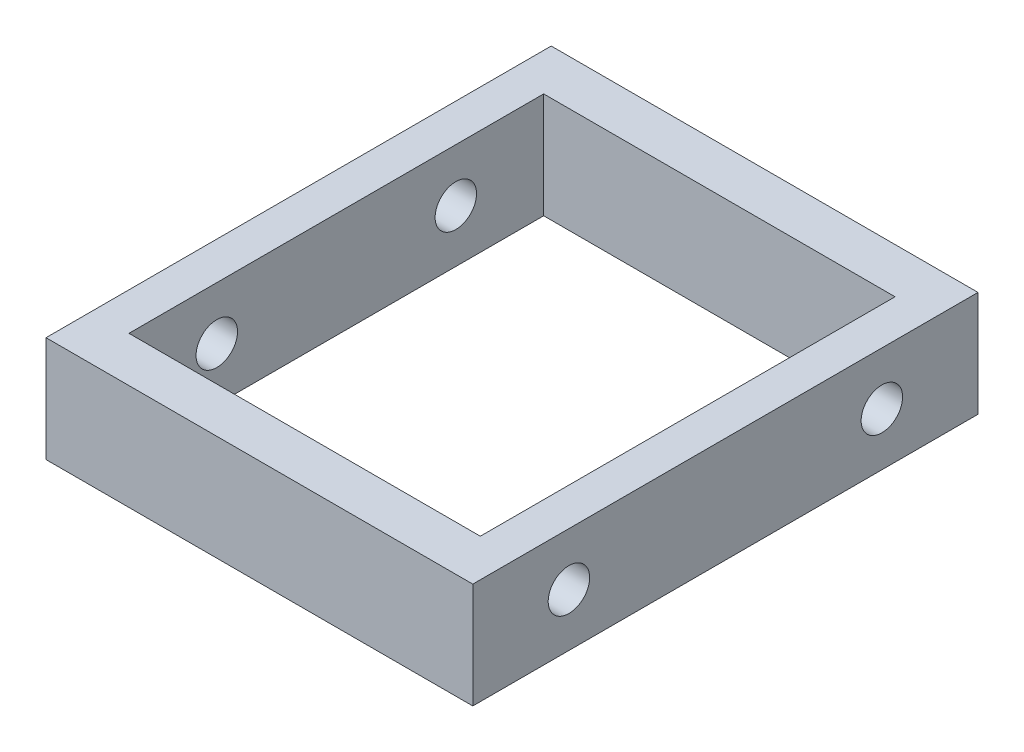
ISO-10303-21;
HEADER;
FILE_DESCRIPTION(('STEP AP214'),'2;1');
FILE_NAME('part.step','',(''),(''),'','','');
FILE_SCHEMA(('AUTOMOTIVE_DESIGN { 1 0 10303 214 1 1 1 1 }'));
ENDSEC;
DATA;
#1=APPLICATION_CONTEXT('core data for automotive mechanical design processes');
#2=APPLICATION_PROTOCOL_DEFINITION('international standard','automotive_design',2000,#1);
#3=PRODUCT_CONTEXT('',#1,'mechanical');
#4=PRODUCT('Part','Part','',(#3));
#5=PRODUCT_RELATED_PRODUCT_CATEGORY('part','',(#4));
#6=PRODUCT_DEFINITION_FORMATION('','',#4);
#7=PRODUCT_DEFINITION_CONTEXT('part definition',#1,'design');
#8=PRODUCT_DEFINITION('design','',#6,#7);
#9=PRODUCT_DEFINITION_SHAPE('','',#8);
#10=(LENGTH_UNIT() NAMED_UNIT(*) SI_UNIT(.MILLI.,.METRE.));
#11=(NAMED_UNIT(*) PLANE_ANGLE_UNIT() SI_UNIT($,.RADIAN.));
#12=(NAMED_UNIT(*) SI_UNIT($,.STERADIAN.) SOLID_ANGLE_UNIT());
#13=UNCERTAINTY_MEASURE_WITH_UNIT(LENGTH_MEASURE(1.E-05),#10,'distance_accuracy_value','');
#14=(GEOMETRIC_REPRESENTATION_CONTEXT(3) GLOBAL_UNCERTAINTY_ASSIGNED_CONTEXT((#13)) GLOBAL_UNIT_ASSIGNED_CONTEXT((#10,
#11,#12)) REPRESENTATION_CONTEXT('',''));
#15=CARTESIAN_POINT('',(0.,0.,0.));
#16=DIRECTION('',(0.,0.,1.));
#17=DIRECTION('',(1.,0.,0.));
#18=AXIS2_PLACEMENT_3D('',#15,#16,#17);
#19=CARTESIAN_POINT('',(0.,14.,33.5));
#20=DIRECTION('',(0.,0.,-1.));
#21=DIRECTION('',(-1.,0.,0.));
#22=AXIS2_PLACEMENT_3D('',#19,#20,#21);
#23=PLANE('',#22);
#24=DIRECTION('',(0.,1.,0.));
#25=VECTOR('',#24,1.);
#26=CARTESIAN_POINT('',(-28.3,14.,33.5));
#27=LINE('',#26,#25);
#28=CARTESIAN_POINT('',(-28.3,0.,33.5));
#29=VERTEX_POINT('',#28);
#30=CARTESIAN_POINT('',(-28.3,14.,33.5));
#31=VERTEX_POINT('',#30);
#32=EDGE_CURVE('E385',#29,#31,#27,.T.);
#33=ORIENTED_EDGE('',*,*,#32,.F.);
#34=DIRECTION('',(1.,0.,0.));
#35=VECTOR('',#34,1.);
#36=CARTESIAN_POINT('',(0.,0.,33.5));
#37=LINE('',#36,#35);
#38=CARTESIAN_POINT('',(28.3,0.,33.5));
#39=VERTEX_POINT('',#38);
#40=EDGE_CURVE('E312',#29,#39,#37,.T.);
#41=ORIENTED_EDGE('',*,*,#40,.T.);
#42=DIRECTION('',(0.,-1.,0.));
#43=VECTOR('',#42,1.);
#44=CARTESIAN_POINT('',(28.3,14.,33.5));
#45=LINE('',#44,#43);
#46=CARTESIAN_POINT('',(28.3,14.,33.5));
#47=VERTEX_POINT('',#46);
#48=EDGE_CURVE('E13',#47,#39,#45,.T.);
#49=ORIENTED_EDGE('',*,*,#48,.F.);
#50=DIRECTION('',(1.,0.,0.));
#51=VECTOR('',#50,1.);
#52=CARTESIAN_POINT('',(0.,14.,33.5));
#53=LINE('',#52,#51);
#54=EDGE_CURVE('E276',#31,#47,#53,.T.);
#55=ORIENTED_EDGE('',*,*,#54,.F.);
#56=EDGE_LOOP('',(#33,#41,#49,#55));
#57=FACE_BOUND('',#56,.T.);
#58=ADVANCED_FACE('F192',(#57),#23,.F.);
#59=CARTESIAN_POINT('',(0.,14.,-33.5));
#60=DIRECTION('',(0.,0.,-1.));
#61=DIRECTION('',(-1.,0.,0.));
#62=AXIS2_PLACEMENT_3D('',#59,#60,#61);
#63=PLANE('',#62);
#64=DIRECTION('',(1.,0.,0.));
#65=VECTOR('',#64,1.);
#66=CARTESIAN_POINT('',(0.,0.,-33.5));
#67=LINE('',#66,#65);
#68=CARTESIAN_POINT('',(-28.3,0.,-33.5));
#69=VERTEX_POINT('',#68);
#70=CARTESIAN_POINT('',(28.3,0.,-33.5));
#71=VERTEX_POINT('',#70);
#72=EDGE_CURVE('E245',#69,#71,#67,.T.);
#73=ORIENTED_EDGE('',*,*,#72,.F.);
#74=DIRECTION('',(0.,-1.,0.));
#75=VECTOR('',#74,1.);
#76=CARTESIAN_POINT('',(-28.3,14.,-33.5000000000001));
#77=LINE('',#76,#75);
#78=CARTESIAN_POINT('',(-28.3,14.,-33.5000000000001));
#79=VERTEX_POINT('',#78);
#80=EDGE_CURVE('E209',#79,#69,#77,.T.);
#81=ORIENTED_EDGE('',*,*,#80,.F.);
#82=DIRECTION('',(1.,0.,0.));
#83=VECTOR('',#82,1.);
#84=CARTESIAN_POINT('',(0.,14.,-33.5));
#85=LINE('',#84,#83);
#86=CARTESIAN_POINT('',(28.3,14.,-33.5));
#87=VERTEX_POINT('',#86);
#88=EDGE_CURVE('E299',#79,#87,#85,.T.);
#89=ORIENTED_EDGE('',*,*,#88,.T.);
#90=DIRECTION('',(0.,-1.,0.));
#91=VECTOR('',#90,1.);
#92=CARTESIAN_POINT('',(28.3,14.,-33.5));
#93=LINE('',#92,#91);
#94=EDGE_CURVE('E201',#87,#71,#93,.T.);
#95=ORIENTED_EDGE('',*,*,#94,.T.);
#96=EDGE_LOOP('',(#73,#81,#89,#95));
#97=FACE_BOUND('',#96,.T.);
#98=ADVANCED_FACE('F339',(#97),#63,.T.);
#99=CARTESIAN_POINT('',(0.,14.,0.));
#100=DIRECTION('',(0.,1.,0.));
#101=DIRECTION('',(0.,0.,1.));
#102=AXIS2_PLACEMENT_3D('',#99,#100,#101);
#103=PLANE('',#102);
#104=DIRECTION('',(0.,0.,-1.));
#105=VECTOR('',#104,1.);
#106=CARTESIAN_POINT('',(23.3,14.,0.));
#107=LINE('',#106,#105);
#108=CARTESIAN_POINT('',(23.3,14.,27.5));
#109=VERTEX_POINT('',#108);
#110=CARTESIAN_POINT('',(23.3,14.,-27.5));
#111=VERTEX_POINT('',#110);
#112=EDGE_CURVE('E269',#109,#111,#107,.T.);
#113=ORIENTED_EDGE('',*,*,#112,.F.);
#114=DIRECTION('',(1.,0.,0.));
#115=VECTOR('',#114,1.);
#116=CARTESIAN_POINT('',(0.,14.,27.5));
#117=LINE('',#116,#115);
#118=CARTESIAN_POINT('',(-23.3,14.,27.5));
#119=VERTEX_POINT('',#118);
#120=EDGE_CURVE('E287',#119,#109,#117,.T.);
#121=ORIENTED_EDGE('',*,*,#120,.F.);
#122=DIRECTION('',(0.,0.,-1.));
#123=VECTOR('',#122,1.);
#124=CARTESIAN_POINT('',(-23.3,14.,0.));
#125=LINE('',#124,#123);
#126=CARTESIAN_POINT('',(-23.3,14.,-27.5));
#127=VERTEX_POINT('',#126);
#128=EDGE_CURVE('E272',#119,#127,#125,.T.);
#129=ORIENTED_EDGE('',*,*,#128,.T.);
#130=DIRECTION('',(1.,0.,0.));
#131=VECTOR('',#130,1.);
#132=CARTESIAN_POINT('',(0.,14.,-27.5));
#133=LINE('',#132,#131);
#134=EDGE_CURVE('E265',#127,#111,#133,.T.);
#135=ORIENTED_EDGE('',*,*,#134,.T.);
#136=EDGE_LOOP('',(#113,#121,#129,#135));
#137=FACE_BOUND('',#136,.T.);
#138=ORIENTED_EDGE('',*,*,#88,.F.);
#139=DIRECTION('',(0.,0.,-1.));
#140=VECTOR('',#139,1.);
#141=CARTESIAN_POINT('',(-28.3,14.,0.));
#142=LINE('',#141,#140);
#143=EDGE_CURVE('E285',#31,#79,#142,.T.);
#144=ORIENTED_EDGE('',*,*,#143,.F.);
#145=ORIENTED_EDGE('',*,*,#54,.T.);
#146=DIRECTION('',(0.,0.,-1.));
#147=VECTOR('',#146,1.);
#148=CARTESIAN_POINT('',(28.3,14.,0.));
#149=LINE('',#148,#147);
#150=EDGE_CURVE('E218',#47,#87,#149,.T.);
#151=ORIENTED_EDGE('',*,*,#150,.T.);
#152=EDGE_LOOP('',(#138,#144,#145,#151));
#153=FACE_BOUND('',#152,.T.);
#154=ADVANCED_FACE('F267',(#137,#153),#103,.T.);
#155=CARTESIAN_POINT('',(0.,0.,0.));
#156=DIRECTION('',(0.,1.,0.));
#157=DIRECTION('',(0.,0.,1.));
#158=AXIS2_PLACEMENT_3D('',#155,#156,#157);
#159=PLANE('',#158);
#160=DIRECTION('',(0.,0.,-1.));
#161=VECTOR('',#160,1.);
#162=CARTESIAN_POINT('',(23.3,0.,0.));
#163=LINE('',#162,#161);
#164=CARTESIAN_POINT('',(23.3,0.,27.5));
#165=VERTEX_POINT('',#164);
#166=CARTESIAN_POINT('',(23.3,0.,-27.5));
#167=VERTEX_POINT('',#166);
#168=EDGE_CURVE('E303',#165,#167,#163,.T.);
#169=ORIENTED_EDGE('',*,*,#168,.T.);
#170=DIRECTION('',(1.,0.,0.));
#171=VECTOR('',#170,1.);
#172=CARTESIAN_POINT('',(0.,0.,-27.5));
#173=LINE('',#172,#171);
#174=CARTESIAN_POINT('',(-23.3,0.,-27.5));
#175=VERTEX_POINT('',#174);
#176=EDGE_CURVE('E282',#175,#167,#173,.T.);
#177=ORIENTED_EDGE('',*,*,#176,.F.);
#178=DIRECTION('',(0.,0.,-1.));
#179=VECTOR('',#178,1.);
#180=CARTESIAN_POINT('',(-23.3,0.,0.));
#181=LINE('',#180,#179);
#182=CARTESIAN_POINT('',(-23.3,0.,27.5));
#183=VERTEX_POINT('',#182);
#184=EDGE_CURVE('E309',#183,#175,#181,.T.);
#185=ORIENTED_EDGE('',*,*,#184,.F.);
#186=DIRECTION('',(1.,0.,0.));
#187=VECTOR('',#186,1.);
#188=CARTESIAN_POINT('',(0.,0.,27.5));
#189=LINE('',#188,#187);
#190=EDGE_CURVE('E305',#183,#165,#189,.T.);
#191=ORIENTED_EDGE('',*,*,#190,.T.);
#192=EDGE_LOOP('',(#169,#177,#185,#191));
#193=FACE_BOUND('',#192,.T.);
#194=DIRECTION('',(0.,0.,1.));
#195=VECTOR('',#194,1.);
#196=CARTESIAN_POINT('',(-28.3,0.,0.));
#197=LINE('',#196,#195);
#198=EDGE_CURVE('E389',#69,#29,#197,.T.);
#199=ORIENTED_EDGE('',*,*,#198,.F.);
#200=ORIENTED_EDGE('',*,*,#72,.T.);
#201=DIRECTION('',(0.,0.,-1.));
#202=VECTOR('',#201,1.);
#203=CARTESIAN_POINT('',(28.3,0.,0.));
#204=LINE('',#203,#202);
#205=EDGE_CURVE('E290',#39,#71,#204,.T.);
#206=ORIENTED_EDGE('',*,*,#205,.F.);
#207=ORIENTED_EDGE('',*,*,#40,.F.);
#208=EDGE_LOOP('',(#199,#200,#206,#207));
#209=FACE_BOUND('',#208,.T.);
#210=ADVANCED_FACE('F324',(#193,#209),#159,.F.);
#211=CARTESIAN_POINT('',(-40.3,7.,15.85));
#212=DIRECTION('',(1.,0.,0.));
#213=DIRECTION('',(0.,0.,-1.));
#214=AXIS2_PLACEMENT_3D('',#211,#212,#213);
#215=CYLINDRICAL_SURFACE('',#214,2.75);
#216=CARTESIAN_POINT('',(-23.3,7.,15.85));
#217=DIRECTION('',(1.,0.,0.));
#218=DIRECTION('',(0.,0.,-1.));
#219=AXIS2_PLACEMENT_3D('',#216,#217,#218);
#220=CIRCLE('',#219,2.75);
#221=CARTESIAN_POINT('',(-23.3,7.,13.1));
#222=VERTEX_POINT('',#221);
#223=EDGE_CURVE('E391',#222,#222,#220,.T.);
#224=ORIENTED_EDGE('',*,*,#223,.T.);
#225=EDGE_LOOP('',(#224));
#226=FACE_BOUND('',#225,.T.);
#227=CARTESIAN_POINT('',(-28.3,7.,15.85));
#228=DIRECTION('',(-1.,0.,0.));
#229=DIRECTION('',(0.,-1.,0.));
#230=AXIS2_PLACEMENT_3D('',#227,#228,#229);
#231=CIRCLE('',#230,2.75);
#232=CARTESIAN_POINT('',(-28.3,4.25,15.85));
#233=VERTEX_POINT('',#232);
#234=EDGE_CURVE('E380',#233,#233,#231,.F.);
#235=ORIENTED_EDGE('',*,*,#234,.F.);
#236=EDGE_LOOP('',(#235));
#237=FACE_BOUND('',#236,.T.);
#238=ADVANCED_FACE('F356',(#226,#237),#215,.F.);
#239=CARTESIAN_POINT('',(-40.3,7.,-15.85));
#240=DIRECTION('',(1.,0.,0.));
#241=DIRECTION('',(0.,0.,-1.));
#242=AXIS2_PLACEMENT_3D('',#239,#240,#241);
#243=CYLINDRICAL_SURFACE('',#242,2.75);
#244=CARTESIAN_POINT('',(-23.3,7.,-15.85));
#245=DIRECTION('',(1.,0.,0.));
#246=DIRECTION('',(0.,0.,-1.));
#247=AXIS2_PLACEMENT_3D('',#244,#245,#246);
#248=CIRCLE('',#247,2.75);
#249=CARTESIAN_POINT('',(-23.3,7.,-18.6));
#250=VERTEX_POINT('',#249);
#251=EDGE_CURVE('E399',#250,#250,#248,.T.);
#252=ORIENTED_EDGE('',*,*,#251,.T.);
#253=EDGE_LOOP('',(#252));
#254=FACE_BOUND('',#253,.T.);
#255=CARTESIAN_POINT('',(-28.3,7.,-15.85));
#256=DIRECTION('',(-1.,0.,0.));
#257=DIRECTION('',(0.,-1.,0.));
#258=AXIS2_PLACEMENT_3D('',#255,#256,#257);
#259=CIRCLE('',#258,2.75);
#260=CARTESIAN_POINT('',(-28.3,4.25,-15.85));
#261=VERTEX_POINT('',#260);
#262=EDGE_CURVE('E196',#261,#261,#259,.F.);
#263=ORIENTED_EDGE('',*,*,#262,.F.);
#264=EDGE_LOOP('',(#263));
#265=FACE_BOUND('',#264,.T.);
#266=ADVANCED_FACE('F351',(#254,#265),#243,.F.);
#267=CARTESIAN_POINT('',(28.3,14.,0.));
#268=DIRECTION('',(-1.,0.,0.));
#269=DIRECTION('',(0.,0.,1.));
#270=AXIS2_PLACEMENT_3D('',#267,#268,#269);
#271=PLANE('',#270);
#272=CARTESIAN_POINT('',(28.3,7.,20.75));
#273=DIRECTION('',(1.,0.,0.));
#274=DIRECTION('',(0.,0.,-1.));
#275=AXIS2_PLACEMENT_3D('',#272,#273,#274);
#276=CIRCLE('',#275,2.75);
#277=CARTESIAN_POINT('',(28.3,7.,18.));
#278=VERTEX_POINT('',#277);
#279=EDGE_CURVE('E405',#278,#278,#276,.T.);
#280=ORIENTED_EDGE('',*,*,#279,.F.);
#281=EDGE_LOOP('',(#280));
#282=FACE_BOUND('',#281,.T.);
#283=CARTESIAN_POINT('',(28.3,7.,-20.75));
#284=DIRECTION('',(1.,0.,0.));
#285=DIRECTION('',(0.,0.,-1.));
#286=AXIS2_PLACEMENT_3D('',#283,#284,#285);
#287=CIRCLE('',#286,2.75);
#288=CARTESIAN_POINT('',(28.3,7.,-23.5));
#289=VERTEX_POINT('',#288);
#290=EDGE_CURVE('E402',#289,#289,#287,.T.);
#291=ORIENTED_EDGE('',*,*,#290,.F.);
#292=EDGE_LOOP('',(#291));
#293=FACE_BOUND('',#292,.T.);
#294=ORIENTED_EDGE('',*,*,#205,.T.);
#295=ORIENTED_EDGE('',*,*,#94,.F.);
#296=ORIENTED_EDGE('',*,*,#150,.F.);
#297=ORIENTED_EDGE('',*,*,#48,.T.);
#298=EDGE_LOOP('',(#294,#295,#296,#297));
#299=FACE_BOUND('',#298,.T.);
#300=ADVANCED_FACE('F349',(#282,#293,#299),#271,.F.);
#301=CARTESIAN_POINT('',(23.3,14.,0.));
#302=DIRECTION('',(-1.,0.,0.));
#303=DIRECTION('',(0.,0.,1.));
#304=AXIS2_PLACEMENT_3D('',#301,#302,#303);
#305=PLANE('',#304);
#306=CARTESIAN_POINT('',(23.3,7.,20.75));
#307=DIRECTION('',(-1.,0.,0.));
#308=DIRECTION('',(0.,0.,1.));
#309=AXIS2_PLACEMENT_3D('',#306,#307,#308);
#310=CIRCLE('',#309,2.75);
#311=CARTESIAN_POINT('',(23.3,7.,23.5));
#312=VERTEX_POINT('',#311);
#313=EDGE_CURVE('E306',#312,#312,#310,.F.);
#314=ORIENTED_EDGE('',*,*,#313,.T.);
#315=EDGE_LOOP('',(#314));
#316=FACE_BOUND('',#315,.T.);
#317=CARTESIAN_POINT('',(23.3,7.,-20.75));
#318=DIRECTION('',(-1.,0.,0.));
#319=DIRECTION('',(0.,0.,1.));
#320=AXIS2_PLACEMENT_3D('',#317,#318,#319);
#321=CIRCLE('',#320,2.75);
#322=CARTESIAN_POINT('',(23.3,7.,-18.));
#323=VERTEX_POINT('',#322);
#324=EDGE_CURVE('E293',#323,#323,#321,.F.);
#325=ORIENTED_EDGE('',*,*,#324,.T.);
#326=EDGE_LOOP('',(#325));
#327=FACE_BOUND('',#326,.T.);
#328=ORIENTED_EDGE('',*,*,#168,.F.);
#329=DIRECTION('',(0.,-1.,0.));
#330=VECTOR('',#329,1.);
#331=CARTESIAN_POINT('',(23.3,14.,27.5));
#332=LINE('',#331,#330);
#333=EDGE_CURVE('E253',#109,#165,#332,.T.);
#334=ORIENTED_EDGE('',*,*,#333,.F.);
#335=ORIENTED_EDGE('',*,*,#112,.T.);
#336=DIRECTION('',(0.,-1.,0.));
#337=VECTOR('',#336,1.);
#338=CARTESIAN_POINT('',(23.3,14.,-27.5));
#339=LINE('',#338,#337);
#340=EDGE_CURVE('E279',#111,#167,#339,.T.);
#341=ORIENTED_EDGE('',*,*,#340,.T.);
#342=EDGE_LOOP('',(#328,#334,#335,#341));
#343=FACE_BOUND('',#342,.T.);
#344=ADVANCED_FACE('F194',(#316,#327,#343),#305,.T.);
#345=CARTESIAN_POINT('',(0.,14.,27.5));
#346=DIRECTION('',(0.,0.,-1.));
#347=DIRECTION('',(-1.,0.,0.));
#348=AXIS2_PLACEMENT_3D('',#345,#346,#347);
#349=PLANE('',#348);
#350=ORIENTED_EDGE('',*,*,#190,.F.);
#351=DIRECTION('',(0.,-1.,0.));
#352=VECTOR('',#351,1.);
#353=CARTESIAN_POINT('',(-23.3,14.,27.5));
#354=LINE('',#353,#352);
#355=EDGE_CURVE('E318',#119,#183,#354,.T.);
#356=ORIENTED_EDGE('',*,*,#355,.F.);
#357=ORIENTED_EDGE('',*,*,#120,.T.);
#358=ORIENTED_EDGE('',*,*,#333,.T.);
#359=EDGE_LOOP('',(#350,#356,#357,#358));
#360=FACE_BOUND('',#359,.T.);
#361=ADVANCED_FACE('F321',(#360),#349,.T.);
#362=CARTESIAN_POINT('',(-23.3,14.,0.));
#363=DIRECTION('',(-1.,0.,0.));
#364=DIRECTION('',(0.,0.,1.));
#365=AXIS2_PLACEMENT_3D('',#362,#363,#364);
#366=PLANE('',#365);
#367=ORIENTED_EDGE('',*,*,#251,.F.);
#368=EDGE_LOOP('',(#367));
#369=FACE_BOUND('',#368,.T.);
#370=ORIENTED_EDGE('',*,*,#223,.F.);
#371=EDGE_LOOP('',(#370));
#372=FACE_BOUND('',#371,.T.);
#373=ORIENTED_EDGE('',*,*,#184,.T.);
#374=DIRECTION('',(0.,-1.,0.));
#375=VECTOR('',#374,1.);
#376=CARTESIAN_POINT('',(-23.3,14.,-27.5));
#377=LINE('',#376,#375);
#378=EDGE_CURVE('E284',#127,#175,#377,.T.);
#379=ORIENTED_EDGE('',*,*,#378,.F.);
#380=ORIENTED_EDGE('',*,*,#128,.F.);
#381=ORIENTED_EDGE('',*,*,#355,.T.);
#382=EDGE_LOOP('',(#373,#379,#380,#381));
#383=FACE_BOUND('',#382,.T.);
#384=ADVANCED_FACE('F326',(#369,#372,#383),#366,.F.);
#385=CARTESIAN_POINT('',(0.,14.,-27.5));
#386=DIRECTION('',(0.,0.,-1.));
#387=DIRECTION('',(-1.,0.,0.));
#388=AXIS2_PLACEMENT_3D('',#385,#386,#387);
#389=PLANE('',#388);
#390=ORIENTED_EDGE('',*,*,#176,.T.);
#391=ORIENTED_EDGE('',*,*,#340,.F.);
#392=ORIENTED_EDGE('',*,*,#134,.F.);
#393=ORIENTED_EDGE('',*,*,#378,.T.);
#394=EDGE_LOOP('',(#390,#391,#392,#393));
#395=FACE_BOUND('',#394,.T.);
#396=ADVANCED_FACE('F280',(#395),#389,.F.);
#397=CARTESIAN_POINT('',(15.521825406948,7.,-20.75));
#398=DIRECTION('',(1.,0.,0.));
#399=DIRECTION('',(0.,0.,-1.));
#400=AXIS2_PLACEMENT_3D('',#397,#398,#399);
#401=CYLINDRICAL_SURFACE('',#400,2.75);
#402=ORIENTED_EDGE('',*,*,#290,.T.);
#403=EDGE_LOOP('',(#402));
#404=FACE_BOUND('',#403,.T.);
#405=ORIENTED_EDGE('',*,*,#324,.F.);
#406=EDGE_LOOP('',(#405));
#407=FACE_BOUND('',#406,.T.);
#408=ADVANCED_FACE('F334',(#404,#407),#401,.F.);
#409=CARTESIAN_POINT('',(15.521825406948,7.,20.75));
#410=DIRECTION('',(1.,0.,0.));
#411=DIRECTION('',(0.,0.,-1.));
#412=AXIS2_PLACEMENT_3D('',#409,#410,#411);
#413=CYLINDRICAL_SURFACE('',#412,2.75);
#414=ORIENTED_EDGE('',*,*,#279,.T.);
#415=EDGE_LOOP('',(#414));
#416=FACE_BOUND('',#415,.T.);
#417=ORIENTED_EDGE('',*,*,#313,.F.);
#418=EDGE_LOOP('',(#417));
#419=FACE_BOUND('',#418,.T.);
#420=ADVANCED_FACE('F361',(#416,#419),#413,.F.);
#421=CARTESIAN_POINT('',(-28.3,14.,-33.5000000000001));
#422=DIRECTION('',(-1.,0.,0.));
#423=DIRECTION('',(0.,-1.,0.));
#424=AXIS2_PLACEMENT_3D('',#421,#422,#423);
#425=PLANE('',#424);
#426=ORIENTED_EDGE('',*,*,#234,.T.);
#427=EDGE_LOOP('',(#426));
#428=FACE_BOUND('',#427,.T.);
#429=ORIENTED_EDGE('',*,*,#262,.T.);
#430=EDGE_LOOP('',(#429));
#431=FACE_BOUND('',#430,.T.);
#432=ORIENTED_EDGE('',*,*,#32,.T.);
#433=ORIENTED_EDGE('',*,*,#143,.T.);
#434=ORIENTED_EDGE('',*,*,#80,.T.);
#435=ORIENTED_EDGE('',*,*,#198,.T.);
#436=EDGE_LOOP('',(#432,#433,#434,#435));
#437=FACE_BOUND('',#436,.T.);
#438=ADVANCED_FACE('F365',(#428,#431,#437),#425,.T.);
#439=CLOSED_SHELL('',(#58,#98,#154,#210,#238,#266,#300,#344,#361,#384,#396,#408,#420,#438));
#440=MANIFOLD_SOLID_BREP('B2',#439);
#441=ADVANCED_BREP_SHAPE_REPRESENTATION('',(#18,#440),#14);
#442=SHAPE_DEFINITION_REPRESENTATION(#9,#441);
ENDSEC;
END-ISO-10303-21;
